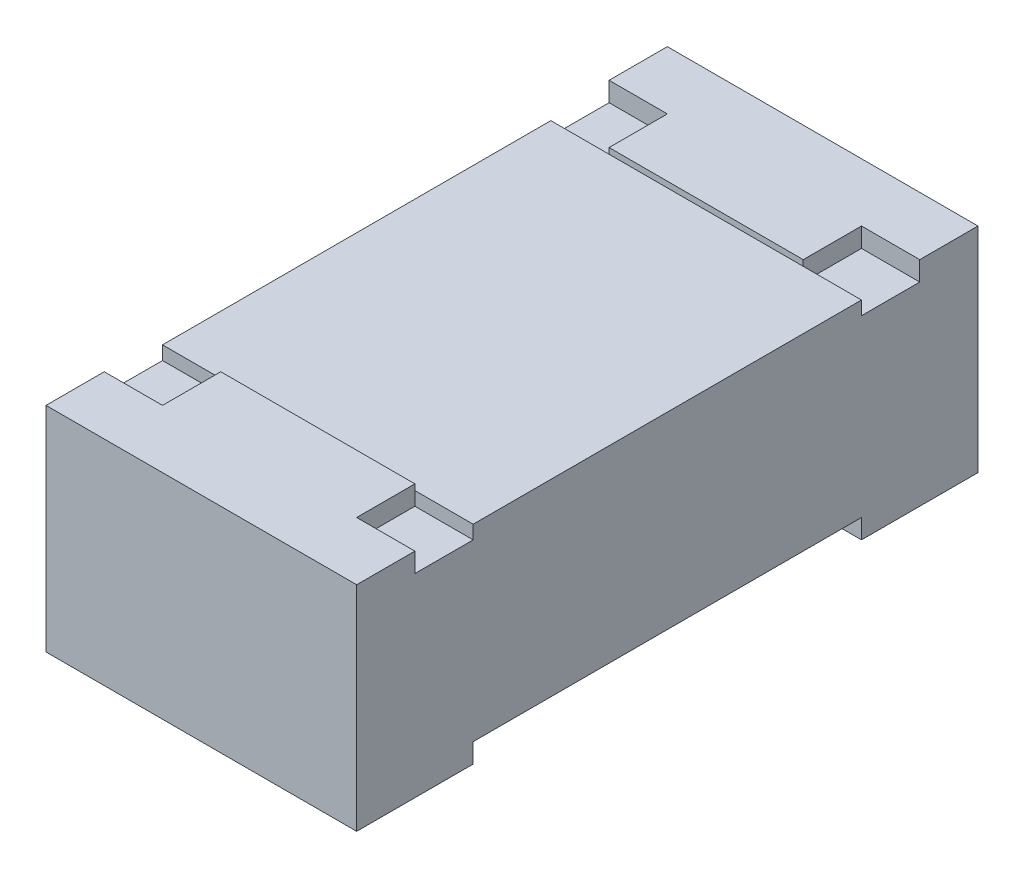
ISO-10303-21;
HEADER;
FILE_DESCRIPTION(('STEP AP214'),'2;1');
FILE_NAME('part.step','',(''),(''),'','','');
FILE_SCHEMA(('AUTOMOTIVE_DESIGN { 1 0 10303 214 1 1 1 1 }'));
ENDSEC;
DATA;
#1=APPLICATION_CONTEXT('core data for automotive mechanical design processes');
#2=APPLICATION_PROTOCOL_DEFINITION('international standard','automotive_design',2000,#1);
#3=PRODUCT_CONTEXT('',#1,'mechanical');
#4=PRODUCT('Part','Part','',(#3));
#5=PRODUCT_RELATED_PRODUCT_CATEGORY('part','',(#4));
#6=PRODUCT_DEFINITION_FORMATION('','',#4);
#7=PRODUCT_DEFINITION_CONTEXT('part definition',#1,'design');
#8=PRODUCT_DEFINITION('design','',#6,#7);
#9=PRODUCT_DEFINITION_SHAPE('','',#8);
#10=(LENGTH_UNIT() NAMED_UNIT(*) SI_UNIT(.MILLI.,.METRE.));
#11=(NAMED_UNIT(*) PLANE_ANGLE_UNIT() SI_UNIT($,.RADIAN.));
#12=(NAMED_UNIT(*) SI_UNIT($,.STERADIAN.) SOLID_ANGLE_UNIT());
#13=UNCERTAINTY_MEASURE_WITH_UNIT(LENGTH_MEASURE(1.E-05),#10,'distance_accuracy_value','');
#14=(GEOMETRIC_REPRESENTATION_CONTEXT(3) GLOBAL_UNCERTAINTY_ASSIGNED_CONTEXT((#13)) GLOBAL_UNIT_ASSIGNED_CONTEXT((#10,
#11,#12)) REPRESENTATION_CONTEXT('',''));
#15=CARTESIAN_POINT('',(0.,0.,0.));
#16=DIRECTION('',(0.,0.,1.));
#17=DIRECTION('',(1.,0.,0.));
#18=AXIS2_PLACEMENT_3D('',#15,#16,#17);
#19=CARTESIAN_POINT('',(-13.5699990165158,1.58166,-11.2730007134836));
#20=DIRECTION('',(0.,-1.,0.));
#21=DIRECTION('',(0.,0.,-1.));
#22=AXIS2_PLACEMENT_3D('',#19,#20,#21);
#23=PLANE('',#22);
#24=DIRECTION('',(-1.,0.,0.));
#25=VECTOR('',#24,1.);
#26=CARTESIAN_POINT('',(-13.5699990165158,1.58166,-11.5730007134836));
#27=LINE('',#26,#25);
#28=CARTESIAN_POINT('',(-13.5699990165158,1.58166,-11.5730007134836));
#29=VERTEX_POINT('',#28);
#30=CARTESIAN_POINT('',(-14.3699990165158,1.58166,-11.5730007134836));
#31=VERTEX_POINT('',#30);
#32=EDGE_CURVE('E19',#29,#31,#27,.T.);
#33=ORIENTED_EDGE('',*,*,#32,.F.);
#34=DIRECTION('',(0.,0.,-1.));
#35=VECTOR('',#34,1.);
#36=CARTESIAN_POINT('',(-13.5699990165158,1.58166,-11.5730007134836));
#37=LINE('',#36,#35);
#38=CARTESIAN_POINT('',(-13.5699990165158,1.58166,-11.2730007134836));
#39=VERTEX_POINT('',#38);
#40=EDGE_CURVE('E295',#39,#29,#37,.T.);
#41=ORIENTED_EDGE('',*,*,#40,.F.);
#42=DIRECTION('',(1.,0.,0.));
#43=VECTOR('',#42,1.);
#44=CARTESIAN_POINT('',(-13.5699990165158,1.58166,-11.2730007134836));
#45=LINE('',#44,#43);
#46=CARTESIAN_POINT('',(-14.3699990165158,1.58166,-11.2730007134836));
#47=VERTEX_POINT('',#46);
#48=EDGE_CURVE('E305',#47,#39,#45,.T.);
#49=ORIENTED_EDGE('',*,*,#48,.F.);
#50=DIRECTION('',(0.,0.,-1.));
#51=VECTOR('',#50,1.);
#52=CARTESIAN_POINT('',(-14.3699990165158,1.58166,-11.5730007134836));
#53=LINE('',#52,#51);
#54=EDGE_CURVE('E231',#47,#31,#53,.T.);
#55=ORIENTED_EDGE('',*,*,#54,.T.);
#56=EDGE_LOOP('',(#33,#41,#49,#55));
#57=FACE_BOUND('',#56,.T.);
#58=ADVANCED_FACE('F16',(#57),#23,.T.);
#59=CARTESIAN_POINT('',(-13.5699990165158,1.58166,-11.5730007134836));
#60=DIRECTION('',(0.,0.,-1.));
#61=DIRECTION('',(-1.,0.,0.));
#62=AXIS2_PLACEMENT_3D('',#59,#60,#61);
#63=PLANE('',#62);
#64=DIRECTION('',(1.,0.,0.));
#65=VECTOR('',#64,1.);
#66=CARTESIAN_POINT('',(-13.5699990165158,1.63166,-11.5730007134836));
#67=LINE('',#66,#65);
#68=CARTESIAN_POINT('',(-13.5699990165158,1.63166,-11.5730007134836));
#69=VERTEX_POINT('',#68);
#70=CARTESIAN_POINT('',(-14.3699990165158,1.63166,-11.5730007134836));
#71=VERTEX_POINT('',#70);
#72=EDGE_CURVE('E247',#69,#71,#67,.F.);
#73=ORIENTED_EDGE('',*,*,#72,.F.);
#74=DIRECTION('',(0.,1.,0.));
#75=VECTOR('',#74,1.);
#76=CARTESIAN_POINT('',(-13.5699990165158,1.58166,-11.5730007134836));
#77=LINE('',#76,#75);
#78=EDGE_CURVE('E226',#29,#69,#77,.T.);
#79=ORIENTED_EDGE('',*,*,#78,.F.);
#80=ORIENTED_EDGE('',*,*,#32,.T.);
#81=DIRECTION('',(0.,1.,0.));
#82=VECTOR('',#81,1.);
#83=CARTESIAN_POINT('',(-14.3699990165158,1.58166,-11.5730007134836));
#84=LINE('',#83,#82);
#85=EDGE_CURVE('E223',#31,#71,#84,.T.);
#86=ORIENTED_EDGE('',*,*,#85,.T.);
#87=EDGE_LOOP('',(#73,#79,#80,#86));
#88=FACE_BOUND('',#87,.T.);
#89=ADVANCED_FACE('F222',(#88),#63,.T.);
#90=CARTESIAN_POINT('',(-13.5699990165158,1.58166,-12.8730007134836));
#91=DIRECTION('',(0.,-1.,0.));
#92=DIRECTION('',(0.,0.,-1.));
#93=AXIS2_PLACEMENT_3D('',#90,#91,#92);
#94=PLANE('',#93);
#95=DIRECTION('',(-1.,0.,0.));
#96=VECTOR('',#95,1.);
#97=CARTESIAN_POINT('',(-13.5699990165158,1.58166,-12.8730007134836));
#98=LINE('',#97,#96);
#99=CARTESIAN_POINT('',(-13.5699990165158,1.58166,-12.8730007134836));
#100=VERTEX_POINT('',#99);
#101=CARTESIAN_POINT('',(-14.3699990165158,1.58166,-12.8730007134836));
#102=VERTEX_POINT('',#101);
#103=EDGE_CURVE('E192',#100,#102,#98,.T.);
#104=ORIENTED_EDGE('',*,*,#103,.F.);
#105=DIRECTION('',(0.,0.,1.));
#106=VECTOR('',#105,1.);
#107=CARTESIAN_POINT('',(-13.5699990165158,1.58166,-12.5730007134836));
#108=LINE('',#107,#106);
#109=CARTESIAN_POINT('',(-13.5699990165158,1.58166,-12.5730007134836));
#110=VERTEX_POINT('',#109);
#111=EDGE_CURVE('E291',#100,#110,#108,.T.);
#112=ORIENTED_EDGE('',*,*,#111,.T.);
#113=DIRECTION('',(1.,0.,0.));
#114=VECTOR('',#113,1.);
#115=CARTESIAN_POINT('',(-13.5699990165158,1.58166,-12.5730007134836));
#116=LINE('',#115,#114);
#117=CARTESIAN_POINT('',(-14.3699990165158,1.58166,-12.5730007134836));
#118=VERTEX_POINT('',#117);
#119=EDGE_CURVE('E187',#118,#110,#116,.T.);
#120=ORIENTED_EDGE('',*,*,#119,.F.);
#121=DIRECTION('',(0.,0.,1.));
#122=VECTOR('',#121,1.);
#123=CARTESIAN_POINT('',(-14.3699990165158,1.58166,-12.5730007134836));
#124=LINE('',#123,#122);
#125=EDGE_CURVE('E203',#102,#118,#124,.T.);
#126=ORIENTED_EDGE('',*,*,#125,.F.);
#127=EDGE_LOOP('',(#104,#112,#120,#126));
#128=FACE_BOUND('',#127,.T.);
#129=ADVANCED_FACE('F204',(#128),#94,.T.);
#130=CARTESIAN_POINT('',(-13.5699990165158,1.58166,-12.5730007134836));
#131=DIRECTION('',(0.,0.,1.));
#132=DIRECTION('',(1.,0.,0.));
#133=AXIS2_PLACEMENT_3D('',#130,#131,#132);
#134=PLANE('',#133);
#135=ORIENTED_EDGE('',*,*,#119,.T.);
#136=DIRECTION('',(0.,1.,0.));
#137=VECTOR('',#136,1.);
#138=CARTESIAN_POINT('',(-13.5699990165158,2.08166,-12.5730007134836));
#139=LINE('',#138,#137);
#140=CARTESIAN_POINT('',(-13.5699990165158,1.63166,-12.5730007134836));
#141=VERTEX_POINT('',#140);
#142=EDGE_CURVE('E289',#110,#141,#139,.T.);
#143=ORIENTED_EDGE('',*,*,#142,.T.);
#144=DIRECTION('',(1.,0.,0.));
#145=VECTOR('',#144,1.);
#146=CARTESIAN_POINT('',(-13.5699990165158,1.63166,-12.5730007134836));
#147=LINE('',#146,#145);
#148=CARTESIAN_POINT('',(-14.3699990165158,1.63166,-12.5730007134836));
#149=VERTEX_POINT('',#148);
#150=EDGE_CURVE('E245',#149,#141,#147,.T.);
#151=ORIENTED_EDGE('',*,*,#150,.F.);
#152=DIRECTION('',(0.,1.,0.));
#153=VECTOR('',#152,1.);
#154=CARTESIAN_POINT('',(-14.3699990165158,2.08166,-12.5730007134836));
#155=LINE('',#154,#153);
#156=EDGE_CURVE('E207',#118,#149,#155,.T.);
#157=ORIENTED_EDGE('',*,*,#156,.F.);
#158=EDGE_LOOP('',(#135,#143,#151,#157));
#159=FACE_BOUND('',#158,.T.);
#160=ADVANCED_FACE('F489',(#159),#134,.T.);
#161=CARTESIAN_POINT('',(-13.5699990165158,2.08166,-12.7230007134836));
#162=DIRECTION('',(0.,0.,-1.));
#163=DIRECTION('',(-1.,0.,0.));
#164=AXIS2_PLACEMENT_3D('',#161,#162,#163);
#165=PLANE('',#164);
#166=DIRECTION('',(0.,1.,0.));
#167=VECTOR('',#166,1.);
#168=CARTESIAN_POINT('',(-13.7199990165158,2.08166,-12.7230007134836));
#169=LINE('',#168,#167);
#170=CARTESIAN_POINT('',(-13.7199990165158,2.13166,-12.7230007134836));
#171=VERTEX_POINT('',#170);
#172=CARTESIAN_POINT('',(-13.7199990165158,2.08166,-12.7230007134836));
#173=VERTEX_POINT('',#172);
#174=EDGE_CURVE('E282',#171,#173,#169,.F.);
#175=ORIENTED_EDGE('',*,*,#174,.T.);
#176=DIRECTION('',(1.,0.,0.));
#177=VECTOR('',#176,1.);
#178=CARTESIAN_POINT('',(-13.5699990165158,2.08166,-12.7230007134836));
#179=LINE('',#178,#177);
#180=CARTESIAN_POINT('',(-13.5699990165158,2.08166,-12.7230007134836));
#181=VERTEX_POINT('',#180);
#182=EDGE_CURVE('E284',#181,#173,#179,.F.);
#183=ORIENTED_EDGE('',*,*,#182,.F.);
#184=DIRECTION('',(0.,1.,0.));
#185=VECTOR('',#184,1.);
#186=CARTESIAN_POINT('',(-13.5699990165158,2.08166,-12.7230007134836));
#187=LINE('',#186,#185);
#188=CARTESIAN_POINT('',(-13.5699990165158,2.13166,-12.7230007134836));
#189=VERTEX_POINT('',#188);
#190=EDGE_CURVE('E287',#181,#189,#187,.T.);
#191=ORIENTED_EDGE('',*,*,#190,.T.);
#192=DIRECTION('',(1.,0.,0.));
#193=VECTOR('',#192,1.);
#194=CARTESIAN_POINT('',(-13.5699990165158,2.13166,-12.7230007134836));
#195=LINE('',#194,#193);
#196=EDGE_CURVE('E274',#171,#189,#195,.T.);
#197=ORIENTED_EDGE('',*,*,#196,.F.);
#198=EDGE_LOOP('',(#175,#183,#191,#197));
#199=FACE_BOUND('',#198,.T.);
#200=ADVANCED_FACE('F491',(#199),#165,.F.);
#201=CARTESIAN_POINT('',(-13.5699990165158,2.13166,-12.8730007134836));
#202=DIRECTION('',(0.,0.,-1.));
#203=DIRECTION('',(-1.,0.,0.));
#204=AXIS2_PLACEMENT_3D('',#201,#202,#203);
#205=PLANE('',#204);
#206=DIRECTION('',(1.,0.,0.));
#207=VECTOR('',#206,1.);
#208=CARTESIAN_POINT('',(-13.5699990165158,2.13166,-12.8730007134836));
#209=LINE('',#208,#207);
#210=CARTESIAN_POINT('',(-13.5699990165158,2.13166,-12.8730007134836));
#211=VERTEX_POINT('',#210);
#212=CARTESIAN_POINT('',(-14.3699990165158,2.13166,-12.8730007134836));
#213=VERTEX_POINT('',#212);
#214=EDGE_CURVE('E269',#211,#213,#209,.F.);
#215=ORIENTED_EDGE('',*,*,#214,.F.);
#216=DIRECTION('',(0.,1.,0.));
#217=VECTOR('',#216,1.);
#218=CARTESIAN_POINT('',(-13.5699990165158,2.08166,-12.8730007134836));
#219=LINE('',#218,#217);
#220=EDGE_CURVE('E198',#211,#100,#219,.F.);
#221=ORIENTED_EDGE('',*,*,#220,.T.);
#222=ORIENTED_EDGE('',*,*,#103,.T.);
#223=DIRECTION('',(0.,1.,0.));
#224=VECTOR('',#223,1.);
#225=CARTESIAN_POINT('',(-14.3699990165158,2.08166,-12.8730007134836));
#226=LINE('',#225,#224);
#227=EDGE_CURVE('E196',#213,#102,#226,.F.);
#228=ORIENTED_EDGE('',*,*,#227,.F.);
#229=EDGE_LOOP('',(#215,#221,#222,#228));
#230=FACE_BOUND('',#229,.T.);
#231=ADVANCED_FACE('F194',(#230),#205,.T.);
#232=CARTESIAN_POINT('',(-14.3699990165158,2.08166,-12.7230007134836));
#233=DIRECTION('',(0.,0.,-1.));
#234=DIRECTION('',(-1.,0.,0.));
#235=AXIS2_PLACEMENT_3D('',#232,#233,#234);
#236=PLANE('',#235);
#237=DIRECTION('',(0.,1.,0.));
#238=VECTOR('',#237,1.);
#239=CARTESIAN_POINT('',(-14.3699990165158,2.08166,-12.7230007134836));
#240=LINE('',#239,#238);
#241=CARTESIAN_POINT('',(-14.3699990165158,2.08166,-12.7230007134836));
#242=VERTEX_POINT('',#241);
#243=CARTESIAN_POINT('',(-14.3699990165158,2.13166,-12.7230007134836));
#244=VERTEX_POINT('',#243);
#245=EDGE_CURVE('E200',#242,#244,#240,.T.);
#246=ORIENTED_EDGE('',*,*,#245,.F.);
#247=DIRECTION('',(1.,0.,0.));
#248=VECTOR('',#247,1.);
#249=CARTESIAN_POINT('',(-13.5699990165158,2.08166,-12.7230007134836));
#250=LINE('',#249,#248);
#251=CARTESIAN_POINT('',(-14.2199990165158,2.08166,-12.7230007134836));
#252=VERTEX_POINT('',#251);
#253=EDGE_CURVE('E249',#252,#242,#250,.F.);
#254=ORIENTED_EDGE('',*,*,#253,.F.);
#255=DIRECTION('',(0.,1.,0.));
#256=VECTOR('',#255,1.);
#257=CARTESIAN_POINT('',(-14.2199990165158,2.08166,-12.7230007134836));
#258=LINE('',#257,#256);
#259=CARTESIAN_POINT('',(-14.2199990165158,2.13166,-12.7230007134836));
#260=VERTEX_POINT('',#259);
#261=EDGE_CURVE('E263',#252,#260,#258,.T.);
#262=ORIENTED_EDGE('',*,*,#261,.T.);
#263=DIRECTION('',(1.,0.,0.));
#264=VECTOR('',#263,1.);
#265=CARTESIAN_POINT('',(-13.5699990165158,2.13166,-12.7230007134836));
#266=LINE('',#265,#264);
#267=EDGE_CURVE('E265',#244,#260,#266,.T.);
#268=ORIENTED_EDGE('',*,*,#267,.F.);
#269=EDGE_LOOP('',(#246,#254,#262,#268));
#270=FACE_BOUND('',#269,.T.);
#271=ADVANCED_FACE('F483',(#270),#236,.F.);
#272=CARTESIAN_POINT('',(-14.3699990165158,2.08166,-11.4230007134836));
#273=DIRECTION('',(0.,0.,1.));
#274=DIRECTION('',(1.,0.,0.));
#275=AXIS2_PLACEMENT_3D('',#272,#273,#274);
#276=PLANE('',#275);
#277=DIRECTION('',(0.,1.,0.));
#278=VECTOR('',#277,1.);
#279=CARTESIAN_POINT('',(-14.2199990165158,2.08166,-11.4230007134836));
#280=LINE('',#279,#278);
#281=CARTESIAN_POINT('',(-14.2199990165158,2.13166,-11.4230007134836));
#282=VERTEX_POINT('',#281);
#283=CARTESIAN_POINT('',(-14.2199990165158,2.08166,-11.4230007134836));
#284=VERTEX_POINT('',#283);
#285=EDGE_CURVE('E335',#282,#284,#280,.F.);
#286=ORIENTED_EDGE('',*,*,#285,.T.);
#287=DIRECTION('',(1.,0.,0.));
#288=VECTOR('',#287,1.);
#289=CARTESIAN_POINT('',(-13.5699990165158,2.08166,-11.4230007134836));
#290=LINE('',#289,#288);
#291=CARTESIAN_POINT('',(-14.3699990165158,2.08166,-11.4230007134836));
#292=VERTEX_POINT('',#291);
#293=EDGE_CURVE('E252',#292,#284,#290,.T.);
#294=ORIENTED_EDGE('',*,*,#293,.F.);
#295=DIRECTION('',(0.,1.,0.));
#296=VECTOR('',#295,1.);
#297=CARTESIAN_POINT('',(-14.3699990165158,1.58166,-11.4230007134836));
#298=LINE('',#297,#296);
#299=CARTESIAN_POINT('',(-14.3699990165158,2.13166,-11.4230007134836));
#300=VERTEX_POINT('',#299);
#301=EDGE_CURVE('E235',#292,#300,#298,.T.);
#302=ORIENTED_EDGE('',*,*,#301,.T.);
#303=DIRECTION('',(1.,0.,0.));
#304=VECTOR('',#303,1.);
#305=CARTESIAN_POINT('',(-13.5699990165158,2.13166,-11.4230007134836));
#306=LINE('',#305,#304);
#307=EDGE_CURVE('E318',#282,#300,#306,.F.);
#308=ORIENTED_EDGE('',*,*,#307,.F.);
#309=EDGE_LOOP('',(#286,#294,#302,#308));
#310=FACE_BOUND('',#309,.T.);
#311=ADVANCED_FACE('F553',(#310),#276,.F.);
#312=CARTESIAN_POINT('',(-13.5699990165158,2.13166,-11.2730007134836));
#313=DIRECTION('',(0.,0.,1.));
#314=DIRECTION('',(1.,0.,0.));
#315=AXIS2_PLACEMENT_3D('',#312,#313,#314);
#316=PLANE('',#315);
#317=ORIENTED_EDGE('',*,*,#48,.T.);
#318=DIRECTION('',(0.,1.,0.));
#319=VECTOR('',#318,1.);
#320=CARTESIAN_POINT('',(-13.5699990165158,1.58166,-11.2730007134836));
#321=LINE('',#320,#319);
#322=CARTESIAN_POINT('',(-13.5699990165158,2.13166,-11.2730007134836));
#323=VERTEX_POINT('',#322);
#324=EDGE_CURVE('E297',#323,#39,#321,.F.);
#325=ORIENTED_EDGE('',*,*,#324,.F.);
#326=DIRECTION('',(1.,0.,0.));
#327=VECTOR('',#326,1.);
#328=CARTESIAN_POINT('',(-13.5699990165158,2.13166,-11.2730007134836));
#329=LINE('',#328,#327);
#330=CARTESIAN_POINT('',(-14.3699990165158,2.13166,-11.2730007134836));
#331=VERTEX_POINT('',#330);
#332=EDGE_CURVE('E311',#331,#323,#329,.T.);
#333=ORIENTED_EDGE('',*,*,#332,.F.);
#334=DIRECTION('',(0.,1.,0.));
#335=VECTOR('',#334,1.);
#336=CARTESIAN_POINT('',(-14.3699990165158,2.13166,-11.2730007134836));
#337=LINE('',#336,#335);
#338=EDGE_CURVE('E237',#331,#47,#337,.F.);
#339=ORIENTED_EDGE('',*,*,#338,.T.);
#340=EDGE_LOOP('',(#317,#325,#333,#339));
#341=FACE_BOUND('',#340,.T.);
#342=ADVANCED_FACE('F309',(#341),#316,.T.);
#343=CARTESIAN_POINT('',(-13.5699990165158,2.08166,-11.4230007134836));
#344=DIRECTION('',(0.,0.,1.));
#345=DIRECTION('',(1.,0.,0.));
#346=AXIS2_PLACEMENT_3D('',#343,#344,#345);
#347=PLANE('',#346);
#348=DIRECTION('',(0.,1.,0.));
#349=VECTOR('',#348,1.);
#350=CARTESIAN_POINT('',(-13.5699990165158,1.58166,-11.4230007134836));
#351=LINE('',#350,#349);
#352=CARTESIAN_POINT('',(-13.5699990165158,2.08166,-11.4230007134836));
#353=VERTEX_POINT('',#352);
#354=CARTESIAN_POINT('',(-13.5699990165158,2.13166,-11.4230007134836));
#355=VERTEX_POINT('',#354);
#356=EDGE_CURVE('E300',#353,#355,#351,.T.);
#357=ORIENTED_EDGE('',*,*,#356,.F.);
#358=DIRECTION('',(1.,0.,0.));
#359=VECTOR('',#358,1.);
#360=CARTESIAN_POINT('',(-13.5699990165158,2.08166,-11.4230007134836));
#361=LINE('',#360,#359);
#362=CARTESIAN_POINT('',(-13.7199990165158,2.08166,-11.4230007134836));
#363=VERTEX_POINT('',#362);
#364=EDGE_CURVE('E400',#363,#353,#361,.T.);
#365=ORIENTED_EDGE('',*,*,#364,.F.);
#366=DIRECTION('',(0.,1.,0.));
#367=VECTOR('',#366,1.);
#368=CARTESIAN_POINT('',(-13.7199990165158,2.08166,-11.4230007134836));
#369=LINE('',#368,#367);
#370=CARTESIAN_POINT('',(-13.7199990165158,2.13166,-11.4230007134836));
#371=VERTEX_POINT('',#370);
#372=EDGE_CURVE('E405',#363,#371,#369,.T.);
#373=ORIENTED_EDGE('',*,*,#372,.T.);
#374=DIRECTION('',(1.,0.,0.));
#375=VECTOR('',#374,1.);
#376=CARTESIAN_POINT('',(-13.5699990165158,2.13166,-11.4230007134836));
#377=LINE('',#376,#375);
#378=EDGE_CURVE('E327',#355,#371,#377,.F.);
#379=ORIENTED_EDGE('',*,*,#378,.F.);
#380=EDGE_LOOP('',(#357,#365,#373,#379));
#381=FACE_BOUND('',#380,.T.);
#382=ADVANCED_FACE('F415',(#381),#347,.F.);
#383=CARTESIAN_POINT('',(-13.5699990165158,1.63166,-12.8230007134836));
#384=DIRECTION('',(0.,-1.,0.));
#385=DIRECTION('',(0.,0.,-1.));
#386=AXIS2_PLACEMENT_3D('',#383,#384,#385);
#387=PLANE('',#386);
#388=ORIENTED_EDGE('',*,*,#150,.T.);
#389=DIRECTION('',(0.,0.,1.));
#390=VECTOR('',#389,1.);
#391=CARTESIAN_POINT('',(-13.5699990165158,1.63166,-12.8230007134836));
#392=LINE('',#391,#390);
#393=EDGE_CURVE('E395',#141,#69,#392,.T.);
#394=ORIENTED_EDGE('',*,*,#393,.T.);
#395=ORIENTED_EDGE('',*,*,#72,.T.);
#396=DIRECTION('',(0.,0.,1.));
#397=VECTOR('',#396,1.);
#398=CARTESIAN_POINT('',(-14.3699990165158,1.63166,-12.8230007134836));
#399=LINE('',#398,#397);
#400=EDGE_CURVE('E234',#149,#71,#399,.T.);
#401=ORIENTED_EDGE('',*,*,#400,.F.);
#402=EDGE_LOOP('',(#388,#394,#395,#401));
#403=FACE_BOUND('',#402,.T.);
#404=ADVANCED_FACE('F243',(#403),#387,.T.);
#405=CARTESIAN_POINT('',(-13.5699990165158,2.08166,-12.8230007134836));
#406=DIRECTION('',(0.,1.,0.));
#407=DIRECTION('',(0.,0.,1.));
#408=AXIS2_PLACEMENT_3D('',#405,#406,#407);
#409=PLANE('',#408);
#410=DIRECTION('',(0.,0.,1.));
#411=VECTOR('',#410,1.);
#412=CARTESIAN_POINT('',(-13.5699990165158,2.08166,-12.8230007134836));
#413=LINE('',#412,#411);
#414=CARTESIAN_POINT('',(-13.5699990165158,2.08166,-12.5730007134836));
#415=VERTEX_POINT('',#414);
#416=EDGE_CURVE('E390',#415,#181,#413,.F.);
#417=ORIENTED_EDGE('',*,*,#416,.T.);
#418=ORIENTED_EDGE('',*,*,#182,.T.);
#419=DIRECTION('',(0.,0.,1.));
#420=VECTOR('',#419,1.);
#421=CARTESIAN_POINT('',(-13.7199990165158,2.08166,-12.7230007134836));
#422=LINE('',#421,#420);
#423=CARTESIAN_POINT('',(-13.7199990165158,2.08166,-12.5730007134836));
#424=VERTEX_POINT('',#423);
#425=EDGE_CURVE('E280',#173,#424,#422,.T.);
#426=ORIENTED_EDGE('',*,*,#425,.T.);
#427=DIRECTION('',(-1.,0.,0.));
#428=VECTOR('',#427,1.);
#429=CARTESIAN_POINT('',(-13.5699990165158,2.08166,-12.5730007134836));
#430=LINE('',#429,#428);
#431=EDGE_CURVE('E384',#415,#424,#430,.T.);
#432=ORIENTED_EDGE('',*,*,#431,.F.);
#433=EDGE_LOOP('',(#417,#418,#426,#432));
#434=FACE_BOUND('',#433,.T.);
#435=ADVANCED_FACE('F543',(#434),#409,.T.);
#436=CARTESIAN_POINT('',(-13.7199990165158,2.08166,-12.7230007134836));
#437=DIRECTION('',(-1.,0.,0.));
#438=DIRECTION('',(0.,0.,1.));
#439=AXIS2_PLACEMENT_3D('',#436,#437,#438);
#440=PLANE('',#439);
#441=DIRECTION('',(0.,1.,0.));
#442=VECTOR('',#441,1.);
#443=CARTESIAN_POINT('',(-13.7199990165158,2.11666,-12.5730007134836));
#444=LINE('',#443,#442);
#445=CARTESIAN_POINT('',(-13.7199990165158,2.11666,-12.5730007134836));
#446=VERTEX_POINT('',#445);
#447=EDGE_CURVE('E387',#424,#446,#444,.T.);
#448=ORIENTED_EDGE('',*,*,#447,.F.);
#449=ORIENTED_EDGE('',*,*,#425,.F.);
#450=ORIENTED_EDGE('',*,*,#174,.F.);
#451=DIRECTION('',(0.,0.,1.));
#452=VECTOR('',#451,1.);
#453=CARTESIAN_POINT('',(-13.7199990165158,2.13166,-12.5730007134836));
#454=LINE('',#453,#452);
#455=CARTESIAN_POINT('',(-13.7199990165158,2.13166,-12.5730007134836));
#456=VERTEX_POINT('',#455);
#457=EDGE_CURVE('E277',#456,#171,#454,.F.);
#458=ORIENTED_EDGE('',*,*,#457,.F.);
#459=DIRECTION('',(0.,1.,0.));
#460=VECTOR('',#459,1.);
#461=CARTESIAN_POINT('',(-13.7199990165158,2.13166,-12.5730007134836));
#462=LINE('',#461,#460);
#463=EDGE_CURVE('E381',#446,#456,#462,.T.);
#464=ORIENTED_EDGE('',*,*,#463,.F.);
#465=EDGE_LOOP('',(#448,#449,#450,#458,#464));
#466=FACE_BOUND('',#465,.T.);
#467=ADVANCED_FACE('F540',(#466),#440,.F.);
#468=CARTESIAN_POINT('',(-13.5699990165158,2.13166,-12.5730007134836));
#469=DIRECTION('',(0.,1.,0.));
#470=DIRECTION('',(0.,0.,1.));
#471=AXIS2_PLACEMENT_3D('',#468,#469,#470);
#472=PLANE('',#471);
#473=DIRECTION('',(0.,0.,-1.));
#474=VECTOR('',#473,1.);
#475=CARTESIAN_POINT('',(-14.2199990165158,2.13166,-12.7230007134836));
#476=LINE('',#475,#474);
#477=CARTESIAN_POINT('',(-14.2199990165158,2.13166,-12.5730007134836));
#478=VERTEX_POINT('',#477);
#479=EDGE_CURVE('E261',#260,#478,#476,.F.);
#480=ORIENTED_EDGE('',*,*,#479,.T.);
#481=DIRECTION('',(1.,0.,0.));
#482=VECTOR('',#481,1.);
#483=CARTESIAN_POINT('',(-13.5699990165158,2.13166,-12.5730007134836));
#484=LINE('',#483,#482);
#485=EDGE_CURVE('E378',#456,#478,#484,.F.);
#486=ORIENTED_EDGE('',*,*,#485,.F.);
#487=ORIENTED_EDGE('',*,*,#457,.T.);
#488=ORIENTED_EDGE('',*,*,#196,.T.);
#489=DIRECTION('',(0.,0.,1.));
#490=VECTOR('',#489,1.);
#491=CARTESIAN_POINT('',(-13.5699990165158,2.13166,-12.5730007134836));
#492=LINE('',#491,#490);
#493=EDGE_CURVE('E271',#189,#211,#492,.F.);
#494=ORIENTED_EDGE('',*,*,#493,.T.);
#495=ORIENTED_EDGE('',*,*,#214,.T.);
#496=DIRECTION('',(0.,0.,1.));
#497=VECTOR('',#496,1.);
#498=CARTESIAN_POINT('',(-14.3699990165158,2.13166,-12.5730007134836));
#499=LINE('',#498,#497);
#500=EDGE_CURVE('E211',#213,#244,#499,.T.);
#501=ORIENTED_EDGE('',*,*,#500,.T.);
#502=ORIENTED_EDGE('',*,*,#267,.T.);
#503=EDGE_LOOP('',(#480,#486,#487,#488,#494,#495,#501,#502));
#504=FACE_BOUND('',#503,.T.);
#505=ADVANCED_FACE('F486',(#504),#472,.T.);
#506=CARTESIAN_POINT('',(-14.2199990165158,2.08166,-12.7230007134836));
#507=DIRECTION('',(1.,0.,0.));
#508=DIRECTION('',(0.,0.,-1.));
#509=AXIS2_PLACEMENT_3D('',#506,#507,#508);
#510=PLANE('',#509);
#511=DIRECTION('',(0.,1.,0.));
#512=VECTOR('',#511,1.);
#513=CARTESIAN_POINT('',(-14.2199990165158,2.13166,-12.5730007134836));
#514=LINE('',#513,#512);
#515=CARTESIAN_POINT('',(-14.2199990165158,2.11666,-12.5730007134836));
#516=VERTEX_POINT('',#515);
#517=EDGE_CURVE('E375',#478,#516,#514,.F.);
#518=ORIENTED_EDGE('',*,*,#517,.F.);
#519=ORIENTED_EDGE('',*,*,#479,.F.);
#520=ORIENTED_EDGE('',*,*,#261,.F.);
#521=DIRECTION('',(0.,0.,1.));
#522=VECTOR('',#521,1.);
#523=CARTESIAN_POINT('',(-14.2199990165158,2.08166,-12.8230007134836));
#524=LINE('',#523,#522);
#525=CARTESIAN_POINT('',(-14.2199990165158,2.08166,-12.5730007134836));
#526=VERTEX_POINT('',#525);
#527=EDGE_CURVE('E255',#526,#252,#524,.F.);
#528=ORIENTED_EDGE('',*,*,#527,.F.);
#529=DIRECTION('',(0.,1.,0.));
#530=VECTOR('',#529,1.);
#531=CARTESIAN_POINT('',(-14.2199990165158,2.11666,-12.5730007134836));
#532=LINE('',#531,#530);
#533=EDGE_CURVE('E372',#516,#526,#532,.F.);
#534=ORIENTED_EDGE('',*,*,#533,.F.);
#535=EDGE_LOOP('',(#518,#519,#520,#528,#534));
#536=FACE_BOUND('',#535,.T.);
#537=ADVANCED_FACE('F534',(#536),#510,.F.);
#538=CARTESIAN_POINT('',(-13.5699990165158,2.08166,-12.8230007134836));
#539=DIRECTION('',(0.,1.,0.));
#540=DIRECTION('',(0.,0.,1.));
#541=AXIS2_PLACEMENT_3D('',#538,#539,#540);
#542=PLANE('',#541);
#543=DIRECTION('',(0.,0.,1.));
#544=VECTOR('',#543,1.);
#545=CARTESIAN_POINT('',(-14.3699990165158,2.08166,-12.8230007134836));
#546=LINE('',#545,#544);
#547=CARTESIAN_POINT('',(-14.3699990165158,2.08166,-12.5730007134836));
#548=VERTEX_POINT('',#547);
#549=EDGE_CURVE('E248',#548,#242,#546,.F.);
#550=ORIENTED_EDGE('',*,*,#549,.F.);
#551=DIRECTION('',(-1.,0.,0.));
#552=VECTOR('',#551,1.);
#553=CARTESIAN_POINT('',(-13.5699990165158,2.08166,-12.5730007134836));
#554=LINE('',#553,#552);
#555=EDGE_CURVE('E369',#526,#548,#554,.T.);
#556=ORIENTED_EDGE('',*,*,#555,.F.);
#557=ORIENTED_EDGE('',*,*,#527,.T.);
#558=ORIENTED_EDGE('',*,*,#253,.T.);
#559=EDGE_LOOP('',(#550,#556,#557,#558));
#560=FACE_BOUND('',#559,.T.);
#561=ADVANCED_FACE('F480',(#560),#542,.T.);
#562=CARTESIAN_POINT('',(-13.5699990165158,2.08166,-12.8230007134836));
#563=DIRECTION('',(0.,1.,0.));
#564=DIRECTION('',(0.,0.,1.));
#565=AXIS2_PLACEMENT_3D('',#562,#563,#564);
#566=PLANE('',#565);
#567=DIRECTION('',(1.,0.,0.));
#568=VECTOR('',#567,1.);
#569=CARTESIAN_POINT('',(-13.5699990165158,2.08166,-11.5730007134836));
#570=LINE('',#569,#568);
#571=CARTESIAN_POINT('',(-14.3699990165158,2.08166,-11.5730007134836));
#572=VERTEX_POINT('',#571);
#573=CARTESIAN_POINT('',(-14.2199990165158,2.08166,-11.5730007134836));
#574=VERTEX_POINT('',#573);
#575=EDGE_CURVE('E359',#572,#574,#570,.T.);
#576=ORIENTED_EDGE('',*,*,#575,.F.);
#577=DIRECTION('',(0.,0.,1.));
#578=VECTOR('',#577,1.);
#579=CARTESIAN_POINT('',(-14.3699990165158,2.08166,-12.8230007134836));
#580=LINE('',#579,#578);
#581=EDGE_CURVE('E337',#572,#292,#580,.T.);
#582=ORIENTED_EDGE('',*,*,#581,.T.);
#583=ORIENTED_EDGE('',*,*,#293,.T.);
#584=DIRECTION('',(0.,0.,-1.));
#585=VECTOR('',#584,1.);
#586=CARTESIAN_POINT('',(-14.2199990165158,2.08166,-12.7230007134836));
#587=LINE('',#586,#585);
#588=EDGE_CURVE('E333',#284,#574,#587,.T.);
#589=ORIENTED_EDGE('',*,*,#588,.T.);
#590=EDGE_LOOP('',(#576,#582,#583,#589));
#591=FACE_BOUND('',#590,.T.);
#592=ADVANCED_FACE('F343',(#591),#566,.T.);
#593=CARTESIAN_POINT('',(-14.2199990165158,2.08166,-12.7230007134836));
#594=DIRECTION('',(1.,0.,0.));
#595=DIRECTION('',(0.,0.,-1.));
#596=AXIS2_PLACEMENT_3D('',#593,#594,#595);
#597=PLANE('',#596);
#598=DIRECTION('',(0.,1.,0.));
#599=VECTOR('',#598,1.);
#600=CARTESIAN_POINT('',(-14.2199990165158,2.11666,-11.5730007134836));
#601=LINE('',#600,#599);
#602=CARTESIAN_POINT('',(-14.2199990165158,2.11666,-11.5730007134836));
#603=VERTEX_POINT('',#602);
#604=EDGE_CURVE('E348',#574,#603,#601,.T.);
#605=ORIENTED_EDGE('',*,*,#604,.F.);
#606=ORIENTED_EDGE('',*,*,#588,.F.);
#607=ORIENTED_EDGE('',*,*,#285,.F.);
#608=DIRECTION('',(0.,0.,1.));
#609=VECTOR('',#608,1.);
#610=CARTESIAN_POINT('',(-14.2199990165158,2.13166,-11.5730007134836));
#611=LINE('',#610,#609);
#612=CARTESIAN_POINT('',(-14.2199990165158,2.13166,-11.5730007134836));
#613=VERTEX_POINT('',#612);
#614=EDGE_CURVE('E324',#613,#282,#611,.T.);
#615=ORIENTED_EDGE('',*,*,#614,.F.);
#616=DIRECTION('',(0.,1.,0.));
#617=VECTOR('',#616,1.);
#618=CARTESIAN_POINT('',(-14.2199990165158,2.13166,-11.5730007134836));
#619=LINE('',#618,#617);
#620=EDGE_CURVE('E351',#603,#613,#619,.T.);
#621=ORIENTED_EDGE('',*,*,#620,.F.);
#622=EDGE_LOOP('',(#605,#606,#607,#615,#621));
#623=FACE_BOUND('',#622,.T.);
#624=ADVANCED_FACE('F346',(#623),#597,.F.);
#625=CARTESIAN_POINT('',(-13.5699990165158,2.13166,-11.5730007134836));
#626=DIRECTION('',(0.,1.,0.));
#627=DIRECTION('',(0.,0.,1.));
#628=AXIS2_PLACEMENT_3D('',#625,#626,#627);
#629=PLANE('',#628);
#630=ORIENTED_EDGE('',*,*,#332,.T.);
#631=DIRECTION('',(0.,0.,1.));
#632=VECTOR('',#631,1.);
#633=CARTESIAN_POINT('',(-13.5699990165158,2.13166,-11.5730007134836));
#634=LINE('',#633,#632);
#635=EDGE_CURVE('E407',#323,#355,#634,.F.);
#636=ORIENTED_EDGE('',*,*,#635,.T.);
#637=ORIENTED_EDGE('',*,*,#378,.T.);
#638=DIRECTION('',(0.,0.,1.));
#639=VECTOR('',#638,1.);
#640=CARTESIAN_POINT('',(-13.7199990165158,2.13166,-12.7230007134836));
#641=LINE('',#640,#639);
#642=CARTESIAN_POINT('',(-13.7199990165158,2.13166,-11.5730007134836));
#643=VERTEX_POINT('',#642);
#644=EDGE_CURVE('E403',#371,#643,#641,.F.);
#645=ORIENTED_EDGE('',*,*,#644,.T.);
#646=DIRECTION('',(-1.,0.,0.));
#647=VECTOR('',#646,1.);
#648=CARTESIAN_POINT('',(-13.5699990165158,2.13166,-11.5730007134836));
#649=LINE('',#648,#647);
#650=EDGE_CURVE('E362',#613,#643,#649,.F.);
#651=ORIENTED_EDGE('',*,*,#650,.F.);
#652=ORIENTED_EDGE('',*,*,#614,.T.);
#653=ORIENTED_EDGE('',*,*,#307,.T.);
#654=DIRECTION('',(0.,0.,1.));
#655=VECTOR('',#654,1.);
#656=CARTESIAN_POINT('',(-14.3699990165158,2.13166,-11.5730007134836));
#657=LINE('',#656,#655);
#658=EDGE_CURVE('E314',#300,#331,#657,.T.);
#659=ORIENTED_EDGE('',*,*,#658,.T.);
#660=EDGE_LOOP('',(#630,#636,#637,#645,#651,#652,#653,#659));
#661=FACE_BOUND('',#660,.T.);
#662=ADVANCED_FACE('F322',(#661),#629,.T.);
#663=CARTESIAN_POINT('',(-13.7199990165158,2.08166,-12.7230007134836));
#664=DIRECTION('',(-1.,0.,0.));
#665=DIRECTION('',(0.,0.,1.));
#666=AXIS2_PLACEMENT_3D('',#663,#664,#665);
#667=PLANE('',#666);
#668=DIRECTION('',(0.,1.,0.));
#669=VECTOR('',#668,1.);
#670=CARTESIAN_POINT('',(-13.7199990165158,2.13166,-11.5730007134836));
#671=LINE('',#670,#669);
#672=CARTESIAN_POINT('',(-13.7199990165158,2.11666,-11.5730007134836));
#673=VERTEX_POINT('',#672);
#674=EDGE_CURVE('E427',#643,#673,#671,.F.);
#675=ORIENTED_EDGE('',*,*,#674,.F.);
#676=ORIENTED_EDGE('',*,*,#644,.F.);
#677=ORIENTED_EDGE('',*,*,#372,.F.);
#678=DIRECTION('',(0.,0.,1.));
#679=VECTOR('',#678,1.);
#680=CARTESIAN_POINT('',(-13.7199990165158,2.08166,-12.8230007134836));
#681=LINE('',#680,#679);
#682=CARTESIAN_POINT('',(-13.7199990165158,2.08166,-11.5730007134836));
#683=VERTEX_POINT('',#682);
#684=EDGE_CURVE('E397',#683,#363,#681,.T.);
#685=ORIENTED_EDGE('',*,*,#684,.F.);
#686=DIRECTION('',(0.,1.,0.));
#687=VECTOR('',#686,1.);
#688=CARTESIAN_POINT('',(-13.7199990165158,2.11666,-11.5730007134836));
#689=LINE('',#688,#687);
#690=EDGE_CURVE('E425',#673,#683,#689,.F.);
#691=ORIENTED_EDGE('',*,*,#690,.F.);
#692=EDGE_LOOP('',(#675,#676,#677,#685,#691));
#693=FACE_BOUND('',#692,.T.);
#694=ADVANCED_FACE('F424',(#693),#667,.F.);
#695=CARTESIAN_POINT('',(-13.5699990165158,2.08166,-12.8230007134836));
#696=DIRECTION('',(0.,1.,0.));
#697=DIRECTION('',(0.,0.,1.));
#698=AXIS2_PLACEMENT_3D('',#695,#696,#697);
#699=PLANE('',#698);
#700=DIRECTION('',(1.,0.,0.));
#701=VECTOR('',#700,1.);
#702=CARTESIAN_POINT('',(-13.5699990165158,2.08166,-11.5730007134836));
#703=LINE('',#702,#701);
#704=CARTESIAN_POINT('',(-13.5699990165158,2.08166,-11.5730007134836));
#705=VERTEX_POINT('',#704);
#706=EDGE_CURVE('E420',#683,#705,#703,.T.);
#707=ORIENTED_EDGE('',*,*,#706,.F.);
#708=ORIENTED_EDGE('',*,*,#684,.T.);
#709=ORIENTED_EDGE('',*,*,#364,.T.);
#710=DIRECTION('',(0.,0.,1.));
#711=VECTOR('',#710,1.);
#712=CARTESIAN_POINT('',(-13.5699990165158,2.08166,-12.8230007134836));
#713=LINE('',#712,#711);
#714=EDGE_CURVE('E393',#353,#705,#713,.F.);
#715=ORIENTED_EDGE('',*,*,#714,.T.);
#716=EDGE_LOOP('',(#707,#708,#709,#715));
#717=FACE_BOUND('',#716,.T.);
#718=ADVANCED_FACE('F419',(#717),#699,.T.);
#719=CARTESIAN_POINT('',(-13.5699990165158,2.11666,-12.5730007134836));
#720=DIRECTION('',(0.,0.,-1.));
#721=DIRECTION('',(-1.,0.,0.));
#722=AXIS2_PLACEMENT_3D('',#719,#720,#721);
#723=PLANE('',#722);
#724=DIRECTION('',(0.,1.,0.));
#725=VECTOR('',#724,1.);
#726=CARTESIAN_POINT('',(-13.5699990165158,2.08166,-12.5730007134836));
#727=LINE('',#726,#725);
#728=CARTESIAN_POINT('',(-13.5699990165158,2.11666,-12.5730007134836));
#729=VERTEX_POINT('',#728);
#730=EDGE_CURVE('E455',#729,#415,#727,.F.);
#731=ORIENTED_EDGE('',*,*,#730,.T.);
#732=ORIENTED_EDGE('',*,*,#431,.T.);
#733=ORIENTED_EDGE('',*,*,#447,.T.);
#734=DIRECTION('',(1.,0.,0.));
#735=VECTOR('',#734,1.);
#736=CARTESIAN_POINT('',(-13.5699990165158,2.11666,-12.5730007134836));
#737=LINE('',#736,#735);
#738=EDGE_CURVE('E452',#729,#446,#737,.F.);
#739=ORIENTED_EDGE('',*,*,#738,.F.);
#740=EDGE_LOOP('',(#731,#732,#733,#739));
#741=FACE_BOUND('',#740,.T.);
#742=ADVANCED_FACE('F466',(#741),#723,.T.);
#743=CARTESIAN_POINT('',(-13.5699990165158,2.13166,-12.5730007134836));
#744=DIRECTION('',(0.,0.,1.));
#745=DIRECTION('',(1.,0.,0.));
#746=AXIS2_PLACEMENT_3D('',#743,#744,#745);
#747=PLANE('',#746);
#748=ORIENTED_EDGE('',*,*,#485,.T.);
#749=ORIENTED_EDGE('',*,*,#517,.T.);
#750=DIRECTION('',(1.,0.,0.));
#751=VECTOR('',#750,1.);
#752=CARTESIAN_POINT('',(-13.5699990165158,2.11666,-12.5730007134836));
#753=LINE('',#752,#751);
#754=EDGE_CURVE('E449',#446,#516,#753,.F.);
#755=ORIENTED_EDGE('',*,*,#754,.F.);
#756=ORIENTED_EDGE('',*,*,#463,.T.);
#757=EDGE_LOOP('',(#748,#749,#755,#756));
#758=FACE_BOUND('',#757,.T.);
#759=ADVANCED_FACE('F472',(#758),#747,.T.);
#760=CARTESIAN_POINT('',(-13.5699990165158,2.11666,-12.5730007134836));
#761=DIRECTION('',(0.,0.,-1.));
#762=DIRECTION('',(-1.,0.,0.));
#763=AXIS2_PLACEMENT_3D('',#760,#761,#762);
#764=PLANE('',#763);
#765=DIRECTION('',(0.,1.,0.));
#766=VECTOR('',#765,1.);
#767=CARTESIAN_POINT('',(-14.3699990165158,2.08166,-12.5730007134836));
#768=LINE('',#767,#766);
#769=CARTESIAN_POINT('',(-14.3699990165158,2.11666,-12.5730007134836));
#770=VERTEX_POINT('',#769);
#771=EDGE_CURVE('E356',#770,#548,#768,.F.);
#772=ORIENTED_EDGE('',*,*,#771,.F.);
#773=DIRECTION('',(1.,0.,0.));
#774=VECTOR('',#773,1.);
#775=CARTESIAN_POINT('',(-13.5699990165158,2.11666,-12.5730007134836));
#776=LINE('',#775,#774);
#777=EDGE_CURVE('E444',#516,#770,#776,.F.);
#778=ORIENTED_EDGE('',*,*,#777,.F.);
#779=ORIENTED_EDGE('',*,*,#533,.T.);
#780=ORIENTED_EDGE('',*,*,#555,.T.);
#781=EDGE_LOOP('',(#772,#778,#779,#780));
#782=FACE_BOUND('',#781,.T.);
#783=ADVANCED_FACE('F476',(#782),#764,.T.);
#784=CARTESIAN_POINT('',(-14.3699990165158,2.08166,-12.5730007134836));
#785=DIRECTION('',(-1.,0.,0.));
#786=DIRECTION('',(0.,0.,1.));
#787=AXIS2_PLACEMENT_3D('',#784,#785,#786);
#788=PLANE('',#787);
#789=ORIENTED_EDGE('',*,*,#156,.T.);
#790=ORIENTED_EDGE('',*,*,#400,.T.);
#791=ORIENTED_EDGE('',*,*,#85,.F.);
#792=ORIENTED_EDGE('',*,*,#54,.F.);
#793=ORIENTED_EDGE('',*,*,#338,.F.);
#794=ORIENTED_EDGE('',*,*,#658,.F.);
#795=ORIENTED_EDGE('',*,*,#301,.F.);
#796=ORIENTED_EDGE('',*,*,#581,.F.);
#797=DIRECTION('',(0.,1.,0.));
#798=VECTOR('',#797,1.);
#799=CARTESIAN_POINT('',(-14.3699990165158,2.11666,-11.5730007134836));
#800=LINE('',#799,#798);
#801=CARTESIAN_POINT('',(-14.3699990165158,2.11666,-11.5730007134836));
#802=VERTEX_POINT('',#801);
#803=EDGE_CURVE('E355',#802,#572,#800,.F.);
#804=ORIENTED_EDGE('',*,*,#803,.F.);
#805=DIRECTION('',(0.,0.,1.));
#806=VECTOR('',#805,1.);
#807=CARTESIAN_POINT('',(-14.3699990165158,2.11666,-12.5730007134836));
#808=LINE('',#807,#806);
#809=EDGE_CURVE('E442',#770,#802,#808,.T.);
#810=ORIENTED_EDGE('',*,*,#809,.F.);
#811=ORIENTED_EDGE('',*,*,#771,.T.);
#812=ORIENTED_EDGE('',*,*,#549,.T.);
#813=ORIENTED_EDGE('',*,*,#245,.T.);
#814=ORIENTED_EDGE('',*,*,#500,.F.);
#815=ORIENTED_EDGE('',*,*,#227,.T.);
#816=ORIENTED_EDGE('',*,*,#125,.T.);
#817=EDGE_LOOP('',(#789,#790,#791,#792,#793,#794,#795,#796,#804,#810,#811,#812,#813,#814,#815,#816));
#818=FACE_BOUND('',#817,.T.);
#819=ADVANCED_FACE('F209',(#818),#788,.T.);
#820=CARTESIAN_POINT('',(-13.5699990165158,2.11666,-11.5730007134836));
#821=DIRECTION('',(0.,0.,1.));
#822=DIRECTION('',(1.,0.,0.));
#823=AXIS2_PLACEMENT_3D('',#820,#821,#822);
#824=PLANE('',#823);
#825=ORIENTED_EDGE('',*,*,#803,.T.);
#826=ORIENTED_EDGE('',*,*,#575,.T.);
#827=ORIENTED_EDGE('',*,*,#604,.T.);
#828=DIRECTION('',(1.,0.,0.));
#829=VECTOR('',#828,1.);
#830=CARTESIAN_POINT('',(-13.5699990165158,2.11666,-11.5730007134836));
#831=LINE('',#830,#829);
#832=EDGE_CURVE('E436',#802,#603,#831,.T.);
#833=ORIENTED_EDGE('',*,*,#832,.F.);
#834=EDGE_LOOP('',(#825,#826,#827,#833));
#835=FACE_BOUND('',#834,.T.);
#836=ADVANCED_FACE('F360',(#835),#824,.T.);
#837=CARTESIAN_POINT('',(-13.5699990165158,2.13166,-11.5730007134836));
#838=DIRECTION('',(0.,0.,-1.));
#839=DIRECTION('',(-1.,0.,0.));
#840=AXIS2_PLACEMENT_3D('',#837,#838,#839);
#841=PLANE('',#840);
#842=ORIENTED_EDGE('',*,*,#650,.T.);
#843=ORIENTED_EDGE('',*,*,#674,.T.);
#844=DIRECTION('',(1.,0.,0.));
#845=VECTOR('',#844,1.);
#846=CARTESIAN_POINT('',(-13.5699990165158,2.11666,-11.5730007134836));
#847=LINE('',#846,#845);
#848=EDGE_CURVE('E432',#603,#673,#847,.T.);
#849=ORIENTED_EDGE('',*,*,#848,.F.);
#850=ORIENTED_EDGE('',*,*,#620,.T.);
#851=EDGE_LOOP('',(#842,#843,#849,#850));
#852=FACE_BOUND('',#851,.T.);
#853=ADVANCED_FACE('F430',(#852),#841,.T.);
#854=CARTESIAN_POINT('',(-13.5699990165158,2.11666,-11.5730007134836));
#855=DIRECTION('',(0.,0.,1.));
#856=DIRECTION('',(1.,0.,0.));
#857=AXIS2_PLACEMENT_3D('',#854,#855,#856);
#858=PLANE('',#857);
#859=DIRECTION('',(0.,1.,0.));
#860=VECTOR('',#859,1.);
#861=CARTESIAN_POINT('',(-13.5699990165158,2.08166,-11.5730007134836));
#862=LINE('',#861,#860);
#863=CARTESIAN_POINT('',(-13.5699990165158,2.11666,-11.5730007134836));
#864=VERTEX_POINT('',#863);
#865=EDGE_CURVE('E34',#705,#864,#862,.T.);
#866=ORIENTED_EDGE('',*,*,#865,.T.);
#867=DIRECTION('',(1.,0.,0.));
#868=VECTOR('',#867,1.);
#869=CARTESIAN_POINT('',(-13.5699990165158,2.11666,-11.5730007134836));
#870=LINE('',#869,#868);
#871=EDGE_CURVE('E25',#673,#864,#870,.T.);
#872=ORIENTED_EDGE('',*,*,#871,.F.);
#873=ORIENTED_EDGE('',*,*,#690,.T.);
#874=ORIENTED_EDGE('',*,*,#706,.T.);
#875=EDGE_LOOP('',(#866,#872,#873,#874));
#876=FACE_BOUND('',#875,.T.);
#877=ADVANCED_FACE('F461',(#876),#858,.T.);
#878=CARTESIAN_POINT('',(-13.5699990165158,2.08166,-12.5730007134836));
#879=DIRECTION('',(-1.,0.,0.));
#880=DIRECTION('',(0.,0.,1.));
#881=AXIS2_PLACEMENT_3D('',#878,#879,#880);
#882=PLANE('',#881);
#883=ORIENTED_EDGE('',*,*,#393,.F.);
#884=ORIENTED_EDGE('',*,*,#142,.F.);
#885=ORIENTED_EDGE('',*,*,#111,.F.);
#886=ORIENTED_EDGE('',*,*,#220,.F.);
#887=ORIENTED_EDGE('',*,*,#493,.F.);
#888=ORIENTED_EDGE('',*,*,#190,.F.);
#889=ORIENTED_EDGE('',*,*,#416,.F.);
#890=ORIENTED_EDGE('',*,*,#730,.F.);
#891=DIRECTION('',(0.,0.,1.));
#892=VECTOR('',#891,1.);
#893=CARTESIAN_POINT('',(-13.5699990165158,2.11666,-12.5730007134836));
#894=LINE('',#893,#892);
#895=EDGE_CURVE('E11',#864,#729,#894,.F.);
#896=ORIENTED_EDGE('',*,*,#895,.F.);
#897=ORIENTED_EDGE('',*,*,#865,.F.);
#898=ORIENTED_EDGE('',*,*,#714,.F.);
#899=ORIENTED_EDGE('',*,*,#356,.T.);
#900=ORIENTED_EDGE('',*,*,#635,.F.);
#901=ORIENTED_EDGE('',*,*,#324,.T.);
#902=ORIENTED_EDGE('',*,*,#40,.T.);
#903=ORIENTED_EDGE('',*,*,#78,.T.);
#904=EDGE_LOOP('',(#883,#884,#885,#886,#887,#888,#889,#890,#896,#897,#898,#899,#900,#901,#902,#903));
#905=FACE_BOUND('',#904,.T.);
#906=ADVANCED_FACE('F412',(#905),#882,.F.);
#907=CARTESIAN_POINT('',(-13.5699990165158,2.11666,-12.5730007134836));
#908=DIRECTION('',(0.,1.,0.));
#909=DIRECTION('',(0.,0.,1.));
#910=AXIS2_PLACEMENT_3D('',#907,#908,#909);
#911=PLANE('',#910);
#912=ORIENTED_EDGE('',*,*,#871,.T.);
#913=ORIENTED_EDGE('',*,*,#895,.T.);
#914=ORIENTED_EDGE('',*,*,#738,.T.);
#915=ORIENTED_EDGE('',*,*,#754,.T.);
#916=ORIENTED_EDGE('',*,*,#777,.T.);
#917=ORIENTED_EDGE('',*,*,#809,.T.);
#918=ORIENTED_EDGE('',*,*,#832,.T.);
#919=ORIENTED_EDGE('',*,*,#848,.T.);
#920=EDGE_LOOP('',(#912,#913,#914,#915,#916,#917,#918,#919));
#921=FACE_BOUND('',#920,.T.);
#922=ADVANCED_FACE('F439',(#921),#911,.T.);
#923=CLOSED_SHELL('',(#58,#89,#129,#160,#200,#231,#271,#311,#342,#382,#404,#435,#467,#505,#537,
#561,#592,#624,#662,#694,#718,#742,#759,#783,#819,#836,#853,#877,#906,#922));
#924=MANIFOLD_SOLID_BREP('B1',#923);
#925=ADVANCED_BREP_SHAPE_REPRESENTATION('',(#18,#924),#14);
#926=SHAPE_DEFINITION_REPRESENTATION(#9,#925);
ENDSEC;
END-ISO-10303-21;
